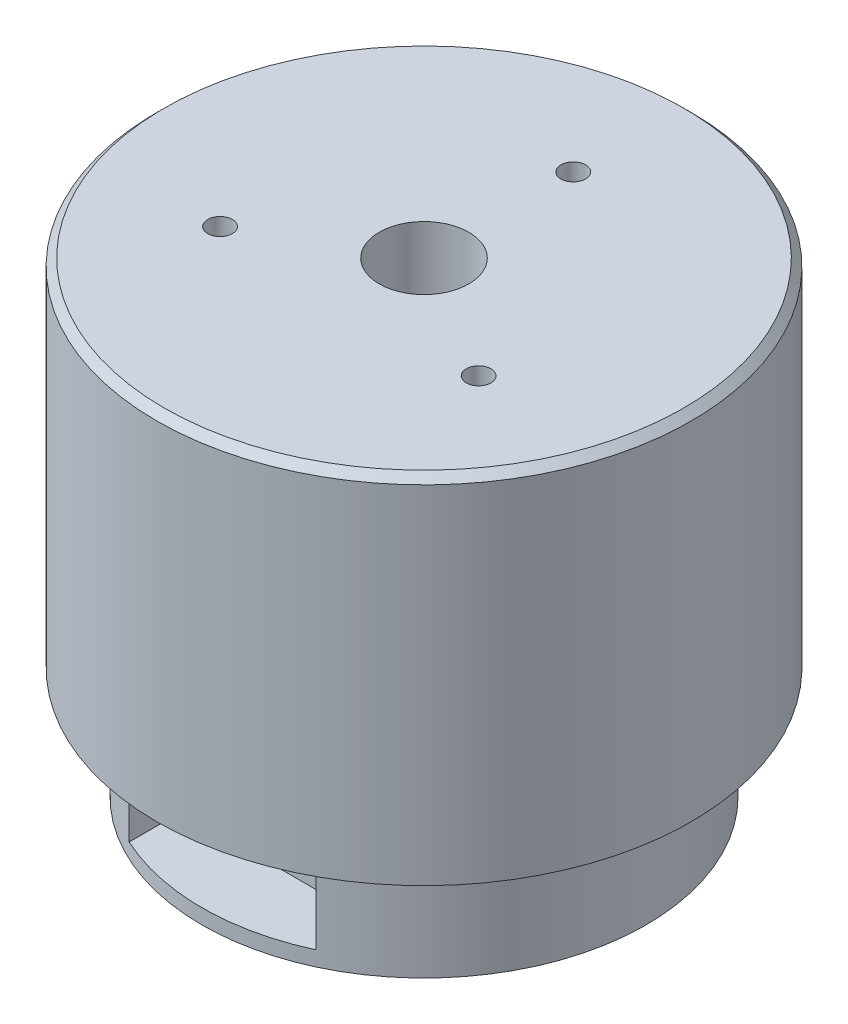
ISO-10303-21;
HEADER;
FILE_DESCRIPTION(('STEP AP214'),'2;1');
FILE_NAME('part.step','',(''),(''),'','','');
FILE_SCHEMA(('AUTOMOTIVE_DESIGN { 1 0 10303 214 1 1 1 1 }'));
ENDSEC;
DATA;
#1=APPLICATION_CONTEXT('core data for automotive mechanical design processes');
#2=APPLICATION_PROTOCOL_DEFINITION('international standard','automotive_design',2000,#1);
#3=PRODUCT_CONTEXT('',#1,'mechanical');
#4=PRODUCT('Part','Part','',(#3));
#5=PRODUCT_RELATED_PRODUCT_CATEGORY('part','',(#4));
#6=PRODUCT_DEFINITION_FORMATION('','',#4);
#7=PRODUCT_DEFINITION_CONTEXT('part definition',#1,'design');
#8=PRODUCT_DEFINITION('design','',#6,#7);
#9=PRODUCT_DEFINITION_SHAPE('','',#8);
#10=(LENGTH_UNIT() NAMED_UNIT(*) SI_UNIT(.MILLI.,.METRE.));
#11=(NAMED_UNIT(*) PLANE_ANGLE_UNIT() SI_UNIT($,.RADIAN.));
#12=(NAMED_UNIT(*) SI_UNIT($,.STERADIAN.) SOLID_ANGLE_UNIT());
#13=UNCERTAINTY_MEASURE_WITH_UNIT(LENGTH_MEASURE(1.E-05),#10,'distance_accuracy_value','');
#14=(GEOMETRIC_REPRESENTATION_CONTEXT(3) GLOBAL_UNCERTAINTY_ASSIGNED_CONTEXT((#13)) GLOBAL_UNIT_ASSIGNED_CONTEXT((#10,
#11,#12)) REPRESENTATION_CONTEXT('',''));
#15=CARTESIAN_POINT('',(0.,0.,0.));
#16=DIRECTION('',(0.,0.,1.));
#17=DIRECTION('',(1.,0.,0.));
#18=AXIS2_PLACEMENT_3D('',#15,#16,#17);
#19=CARTESIAN_POINT('',(0.,16.,0.));
#20=DIRECTION('',(0.,-1.,0.));
#21=DIRECTION('',(0.,0.,-1.));
#22=AXIS2_PLACEMENT_3D('',#19,#20,#21);
#23=CYLINDRICAL_SURFACE('',#22,29.75);
#24=CARTESIAN_POINT('',(0.,0.999999999999999,0.));
#25=DIRECTION('',(0.,1.,0.));
#26=DIRECTION('',(0.,0.,1.));
#27=AXIS2_PLACEMENT_3D('',#24,#25,#26);
#28=CIRCLE('',#27,29.75);
#29=CARTESIAN_POINT('',(0.,0.999999999999999,29.75));
#30=VERTEX_POINT('',#29);
#31=EDGE_CURVE('E152',#30,#30,#28,.T.);
#32=ORIENTED_EDGE('',*,*,#31,.T.);
#33=EDGE_LOOP('',(#32));
#34=FACE_BOUND('',#33,.T.);
#35=DIRECTION('',(0.,-1.,0.));
#36=VECTOR('',#35,1.);
#37=CARTESIAN_POINT('',(-12.5,16.,26.9965275544837));
#38=LINE('',#37,#36);
#39=CARTESIAN_POINT('',(-12.5,16.,26.9965275544837));
#40=VERTEX_POINT('',#39);
#41=CARTESIAN_POINT('',(-12.5,3.,26.9965275544837));
#42=VERTEX_POINT('',#41);
#43=EDGE_CURVE('E89',#40,#42,#38,.T.);
#44=ORIENTED_EDGE('',*,*,#43,.F.);
#45=CARTESIAN_POINT('',(0.,16.,0.));
#46=DIRECTION('',(0.,1.,0.));
#47=DIRECTION('',(0.,0.,1.));
#48=AXIS2_PLACEMENT_3D('',#45,#46,#47);
#49=CIRCLE('',#48,29.75);
#50=CARTESIAN_POINT('',(12.5,16.,26.9965275544837));
#51=VERTEX_POINT('',#50);
#52=EDGE_CURVE('E144',#51,#40,#49,.T.);
#53=ORIENTED_EDGE('',*,*,#52,.F.);
#54=DIRECTION('',(0.,-1.,0.));
#55=VECTOR('',#54,1.);
#56=CARTESIAN_POINT('',(12.5,16.,26.9965275544837));
#57=LINE('',#56,#55);
#58=CARTESIAN_POINT('',(12.5,3.,26.9965275544837));
#59=VERTEX_POINT('',#58);
#60=EDGE_CURVE('E92',#59,#51,#57,.F.);
#61=ORIENTED_EDGE('',*,*,#60,.F.);
#62=CARTESIAN_POINT('',(0.,3.,0.));
#63=DIRECTION('',(0.,1.,0.));
#64=DIRECTION('',(0.,0.,1.));
#65=AXIS2_PLACEMENT_3D('',#62,#63,#64);
#66=CIRCLE('',#65,29.75);
#67=EDGE_CURVE('E11',#42,#59,#66,.T.);
#68=ORIENTED_EDGE('',*,*,#67,.F.);
#69=EDGE_LOOP('',(#44,#53,#61,#68));
#70=FACE_BOUND('',#69,.T.);
#71=ADVANCED_FACE('F36',(#34,#70),#23,.T.);
#72=CARTESIAN_POINT('',(0.,0.,0.));
#73=DIRECTION('',(0.,1.,0.));
#74=DIRECTION('',(0.,0.,1.));
#75=AXIS2_PLACEMENT_3D('',#72,#73,#74);
#76=PLANE('',#75);
#77=CARTESIAN_POINT('',(0.,0.,0.));
#78=DIRECTION('',(0.,1.,0.));
#79=DIRECTION('',(0.,0.,1.));
#80=AXIS2_PLACEMENT_3D('',#77,#78,#79);
#81=CIRCLE('',#80,26.0179491924311);
#82=CARTESIAN_POINT('',(0.,0.,26.0179491924311));
#83=VERTEX_POINT('',#82);
#84=EDGE_CURVE('E44',#83,#83,#81,.F.);
#85=ORIENTED_EDGE('',*,*,#84,.T.);
#86=EDGE_LOOP('',(#85));
#87=FACE_BOUND('',#86,.T.);
#88=ADVANCED_FACE('F157',(#87),#76,.F.);
#89=CARTESIAN_POINT('',(0.,63.5,0.));
#90=DIRECTION('',(0.,-1.,0.));
#91=DIRECTION('',(0.,0.,-1.));
#92=AXIS2_PLACEMENT_3D('',#89,#90,#91);
#93=CYLINDRICAL_SURFACE('',#92,35.8);
#94=CARTESIAN_POINT('',(0.,62.5,0.));
#95=DIRECTION('',(0.,1.,0.));
#96=DIRECTION('',(0.,0.,1.));
#97=AXIS2_PLACEMENT_3D('',#94,#95,#96);
#98=CIRCLE('',#97,35.8);
#99=CARTESIAN_POINT('',(0.,62.5,35.8));
#100=VERTEX_POINT('',#99);
#101=EDGE_CURVE('E149',#100,#100,#98,.F.);
#102=ORIENTED_EDGE('',*,*,#101,.T.);
#103=EDGE_LOOP('',(#102));
#104=FACE_BOUND('',#103,.T.);
#105=CARTESIAN_POINT('',(0.,16.,0.));
#106=DIRECTION('',(0.,1.,0.));
#107=DIRECTION('',(0.,0.,1.));
#108=AXIS2_PLACEMENT_3D('',#105,#106,#107);
#109=CIRCLE('',#108,35.8);
#110=CARTESIAN_POINT('',(0.,16.,35.8));
#111=VERTEX_POINT('',#110);
#112=EDGE_CURVE('E141',#111,#111,#109,.T.);
#113=ORIENTED_EDGE('',*,*,#112,.T.);
#114=EDGE_LOOP('',(#113));
#115=FACE_BOUND('',#114,.T.);
#116=ADVANCED_FACE('F177',(#104,#115),#93,.T.);
#117=CARTESIAN_POINT('',(0.,63.5,0.));
#118=DIRECTION('',(0.,1.,0.));
#119=DIRECTION('',(0.,0.,1.));
#120=AXIS2_PLACEMENT_3D('',#117,#118,#119);
#121=PLANE('',#120);
#122=CARTESIAN_POINT('',(0.,63.5,0.));
#123=DIRECTION('',(0.,1.,0.));
#124=DIRECTION('',(0.,0.,1.));
#125=AXIS2_PLACEMENT_3D('',#122,#123,#124);
#126=CIRCLE('',#125,34.8);
#127=CARTESIAN_POINT('',(0.,63.5,34.8));
#128=VERTEX_POINT('',#127);
#129=EDGE_CURVE('E146',#128,#128,#126,.T.);
#130=ORIENTED_EDGE('',*,*,#129,.T.);
#131=EDGE_LOOP('',(#130));
#132=FACE_BOUND('',#131,.T.);
#133=CARTESIAN_POINT('',(0.,63.5,0.));
#134=DIRECTION('',(0.,1.,0.));
#135=DIRECTION('',(0.,0.,1.));
#136=AXIS2_PLACEMENT_3D('',#133,#134,#135);
#137=CIRCLE('',#136,6.);
#138=CARTESIAN_POINT('',(0.,63.5,6.));
#139=VERTEX_POINT('',#138);
#140=EDGE_CURVE('E117',#139,#139,#137,.T.);
#141=ORIENTED_EDGE('',*,*,#140,.F.);
#142=EDGE_LOOP('',(#141));
#143=FACE_BOUND('',#142,.T.);
#144=CARTESIAN_POINT('',(0.,63.5,-20.));
#145=DIRECTION('',(0.,1.,0.));
#146=DIRECTION('',(0.,0.,1.));
#147=AXIS2_PLACEMENT_3D('',#144,#145,#146);
#148=CIRCLE('',#147,1.65);
#149=CARTESIAN_POINT('',(0.,63.5,-18.35));
#150=VERTEX_POINT('',#149);
#151=EDGE_CURVE('E121',#150,#150,#148,.T.);
#152=ORIENTED_EDGE('',*,*,#151,.F.);
#153=EDGE_LOOP('',(#152));
#154=FACE_BOUND('',#153,.T.);
#155=CARTESIAN_POINT('',(17.3205080756888,63.5,9.99999999999996));
#156=DIRECTION('',(0.,1.,0.));
#157=DIRECTION('',(0.,0.,1.));
#158=AXIS2_PLACEMENT_3D('',#155,#156,#157);
#159=CIRCLE('',#158,1.65);
#160=CARTESIAN_POINT('',(17.3205080756888,63.5,11.65));
#161=VERTEX_POINT('',#160);
#162=EDGE_CURVE('E129',#161,#161,#159,.T.);
#163=ORIENTED_EDGE('',*,*,#162,.F.);
#164=EDGE_LOOP('',(#163));
#165=FACE_BOUND('',#164,.T.);
#166=CARTESIAN_POINT('',(-17.3205080756888,63.5,9.99999999999996));
#167=DIRECTION('',(0.,1.,0.));
#168=DIRECTION('',(0.,0.,1.));
#169=AXIS2_PLACEMENT_3D('',#166,#167,#168);
#170=CIRCLE('',#169,1.65);
#171=CARTESIAN_POINT('',(-17.3205080756888,63.5,11.65));
#172=VERTEX_POINT('',#171);
#173=EDGE_CURVE('E135',#172,#172,#170,.T.);
#174=ORIENTED_EDGE('',*,*,#173,.F.);
#175=EDGE_LOOP('',(#174));
#176=FACE_BOUND('',#175,.T.);
#177=ADVANCED_FACE('F173',(#132,#143,#154,#165,#176),#121,.T.);
#178=CARTESIAN_POINT('',(0.,16.,0.));
#179=DIRECTION('',(0.,1.,0.));
#180=DIRECTION('',(0.,0.,1.));
#181=AXIS2_PLACEMENT_3D('',#178,#179,#180);
#182=PLANE('',#181);
#183=ORIENTED_EDGE('',*,*,#52,.T.);
#184=DIRECTION('',(0.,0.,-1.));
#185=VECTOR('',#184,1.);
#186=CARTESIAN_POINT('',(-12.5,16.,40.));
#187=LINE('',#186,#185);
#188=CARTESIAN_POINT('',(-12.5,16.,20.));
#189=VERTEX_POINT('',#188);
#190=EDGE_CURVE('E111',#40,#189,#187,.T.);
#191=ORIENTED_EDGE('',*,*,#190,.T.);
#192=DIRECTION('',(-1.,0.,0.));
#193=VECTOR('',#192,1.);
#194=CARTESIAN_POINT('',(-12.5,16.,20.));
#195=LINE('',#194,#193);
#196=CARTESIAN_POINT('',(12.5,16.,20.));
#197=VERTEX_POINT('',#196);
#198=EDGE_CURVE('E106',#197,#189,#195,.T.);
#199=ORIENTED_EDGE('',*,*,#198,.F.);
#200=DIRECTION('',(0.,0.,-1.));
#201=VECTOR('',#200,1.);
#202=CARTESIAN_POINT('',(12.5,16.,40.));
#203=LINE('',#202,#201);
#204=EDGE_CURVE('E51',#51,#197,#203,.T.);
#205=ORIENTED_EDGE('',*,*,#204,.F.);
#206=EDGE_LOOP('',(#183,#191,#199,#205));
#207=FACE_BOUND('',#206,.T.);
#208=ORIENTED_EDGE('',*,*,#112,.F.);
#209=EDGE_LOOP('',(#208));
#210=FACE_BOUND('',#209,.T.);
#211=ADVANCED_FACE('F169',(#207,#210),#182,.F.);
#212=CARTESIAN_POINT('',(-17.3205080756888,57.5,9.99999999999996));
#213=DIRECTION('',(0.,1.,0.));
#214=DIRECTION('',(0.,0.,1.));
#215=AXIS2_PLACEMENT_3D('',#212,#213,#214);
#216=CONICAL_SURFACE('',#215,1.65,1.02974425867665);
#217=CARTESIAN_POINT('',(-17.3205080756888,56.5085799786045,9.99999999999996));
#218=VERTEX_POINT('',#217);
#219=VERTEX_LOOP('',#218);
#220=FACE_BOUND('',#219,.T.);
#221=CARTESIAN_POINT('',(-17.3205080756888,57.5,9.99999999999996));
#222=DIRECTION('',(0.,1.,0.));
#223=DIRECTION('',(0.,0.,1.));
#224=AXIS2_PLACEMENT_3D('',#221,#222,#223);
#225=CIRCLE('',#224,1.65);
#226=CARTESIAN_POINT('',(-17.3205080756888,57.5,11.65));
#227=VERTEX_POINT('',#226);
#228=EDGE_CURVE('E138',#227,#227,#225,.T.);
#229=ORIENTED_EDGE('',*,*,#228,.T.);
#230=EDGE_LOOP('',(#229));
#231=FACE_BOUND('',#230,.T.);
#232=ADVANCED_FACE('F172',(#220,#231),#216,.F.);
#233=CARTESIAN_POINT('',(-17.3205080756888,63.5,9.99999999999996));
#234=DIRECTION('',(0.,1.,0.));
#235=DIRECTION('',(0.,0.,1.));
#236=AXIS2_PLACEMENT_3D('',#233,#234,#235);
#237=CYLINDRICAL_SURFACE('',#236,1.65);
#238=ORIENTED_EDGE('',*,*,#228,.F.);
#239=EDGE_LOOP('',(#238));
#240=FACE_BOUND('',#239,.T.);
#241=ORIENTED_EDGE('',*,*,#173,.T.);
#242=EDGE_LOOP('',(#241));
#243=FACE_BOUND('',#242,.T.);
#244=ADVANCED_FACE('F209',(#240,#243),#237,.F.);
#245=CARTESIAN_POINT('',(17.3205080756888,57.5,9.99999999999996));
#246=DIRECTION('',(0.,1.,0.));
#247=DIRECTION('',(0.,0.,1.));
#248=AXIS2_PLACEMENT_3D('',#245,#246,#247);
#249=CONICAL_SURFACE('',#248,1.65,1.02974425867665);
#250=CARTESIAN_POINT('',(17.3205080756888,56.5085799786045,9.99999999999996));
#251=VERTEX_POINT('',#250);
#252=VERTEX_LOOP('',#251);
#253=FACE_BOUND('',#252,.T.);
#254=CARTESIAN_POINT('',(17.3205080756888,57.5,9.99999999999996));
#255=DIRECTION('',(0.,1.,0.));
#256=DIRECTION('',(0.,0.,1.));
#257=AXIS2_PLACEMENT_3D('',#254,#255,#256);
#258=CIRCLE('',#257,1.65);
#259=CARTESIAN_POINT('',(17.3205080756888,57.5,11.65));
#260=VERTEX_POINT('',#259);
#261=EDGE_CURVE('E132',#260,#260,#258,.T.);
#262=ORIENTED_EDGE('',*,*,#261,.T.);
#263=EDGE_LOOP('',(#262));
#264=FACE_BOUND('',#263,.T.);
#265=ADVANCED_FACE('F211',(#253,#264),#249,.F.);
#266=CARTESIAN_POINT('',(17.3205080756888,63.5,9.99999999999996));
#267=DIRECTION('',(0.,1.,0.));
#268=DIRECTION('',(0.,0.,1.));
#269=AXIS2_PLACEMENT_3D('',#266,#267,#268);
#270=CYLINDRICAL_SURFACE('',#269,1.65);
#271=ORIENTED_EDGE('',*,*,#261,.F.);
#272=EDGE_LOOP('',(#271));
#273=FACE_BOUND('',#272,.T.);
#274=ORIENTED_EDGE('',*,*,#162,.T.);
#275=EDGE_LOOP('',(#274));
#276=FACE_BOUND('',#275,.T.);
#277=ADVANCED_FACE('F218',(#273,#276),#270,.F.);
#278=CARTESIAN_POINT('',(0.,57.5,-20.));
#279=DIRECTION('',(0.,1.,0.));
#280=DIRECTION('',(0.,0.,1.));
#281=AXIS2_PLACEMENT_3D('',#278,#279,#280);
#282=CONICAL_SURFACE('',#281,1.65,1.02974425867665);
#283=CARTESIAN_POINT('',(0.,56.5085799786045,-20.));
#284=VERTEX_POINT('',#283);
#285=VERTEX_LOOP('',#284);
#286=FACE_BOUND('',#285,.T.);
#287=CARTESIAN_POINT('',(0.,57.5,-20.));
#288=DIRECTION('',(0.,1.,0.));
#289=DIRECTION('',(0.,0.,1.));
#290=AXIS2_PLACEMENT_3D('',#287,#288,#289);
#291=CIRCLE('',#290,1.65);
#292=CARTESIAN_POINT('',(0.,57.5,-18.35));
#293=VERTEX_POINT('',#292);
#294=EDGE_CURVE('E126',#293,#293,#291,.T.);
#295=ORIENTED_EDGE('',*,*,#294,.T.);
#296=EDGE_LOOP('',(#295));
#297=FACE_BOUND('',#296,.T.);
#298=ADVANCED_FACE('F226',(#286,#297),#282,.F.);
#299=CARTESIAN_POINT('',(0.,63.5,-20.));
#300=DIRECTION('',(0.,1.,0.));
#301=DIRECTION('',(0.,0.,1.));
#302=AXIS2_PLACEMENT_3D('',#299,#300,#301);
#303=CYLINDRICAL_SURFACE('',#302,1.65);
#304=ORIENTED_EDGE('',*,*,#294,.F.);
#305=EDGE_LOOP('',(#304));
#306=FACE_BOUND('',#305,.T.);
#307=ORIENTED_EDGE('',*,*,#151,.T.);
#308=EDGE_LOOP('',(#307));
#309=FACE_BOUND('',#308,.T.);
#310=ADVANCED_FACE('F230',(#306,#309),#303,.F.);
#311=CARTESIAN_POINT('',(0.,43.5,0.));
#312=DIRECTION('',(0.,1.,0.));
#313=DIRECTION('',(0.,0.,1.));
#314=AXIS2_PLACEMENT_3D('',#311,#312,#313);
#315=CYLINDRICAL_SURFACE('',#314,6.);
#316=CARTESIAN_POINT('',(0.,43.5,0.));
#317=DIRECTION('',(0.,1.,0.));
#318=DIRECTION('',(0.,0.,1.));
#319=AXIS2_PLACEMENT_3D('',#316,#317,#318);
#320=CIRCLE('',#319,6.);
#321=CARTESIAN_POINT('',(0.,43.5,6.));
#322=VERTEX_POINT('',#321);
#323=EDGE_CURVE('E118',#322,#322,#320,.T.);
#324=ORIENTED_EDGE('',*,*,#323,.F.);
#325=EDGE_LOOP('',(#324));
#326=FACE_BOUND('',#325,.T.);
#327=ORIENTED_EDGE('',*,*,#140,.T.);
#328=EDGE_LOOP('',(#327));
#329=FACE_BOUND('',#328,.T.);
#330=ADVANCED_FACE('F194',(#326,#329),#315,.F.);
#331=CARTESIAN_POINT('',(0.,43.5,0.));
#332=DIRECTION('',(0.,1.,0.));
#333=DIRECTION('',(0.,0.,1.));
#334=AXIS2_PLACEMENT_3D('',#331,#332,#333);
#335=PLANE('',#334);
#336=ORIENTED_EDGE('',*,*,#323,.T.);
#337=EDGE_LOOP('',(#336));
#338=FACE_BOUND('',#337,.T.);
#339=ADVANCED_FACE('F189',(#338),#335,.T.);
#340=CARTESIAN_POINT('',(0.,63.5,0.));
#341=DIRECTION('',(0.,-1.,0.));
#342=DIRECTION('',(0.,0.,-1.));
#343=AXIS2_PLACEMENT_3D('',#340,#341,#342);
#344=CONICAL_SURFACE('',#343,34.8,0.785398163397441);
#345=ORIENTED_EDGE('',*,*,#101,.F.);
#346=EDGE_LOOP('',(#345));
#347=FACE_BOUND('',#346,.T.);
#348=ORIENTED_EDGE('',*,*,#129,.F.);
#349=EDGE_LOOP('',(#348));
#350=FACE_BOUND('',#349,.T.);
#351=ADVANCED_FACE('F161',(#347,#350),#344,.T.);
#352=CARTESIAN_POINT('',(0.,0.999999999999999,0.));
#353=DIRECTION('',(0.,1.,0.));
#354=DIRECTION('',(0.,0.,1.));
#355=AXIS2_PLACEMENT_3D('',#352,#353,#354);
#356=CONICAL_SURFACE('',#355,29.75,1.30899693899575);
#357=ORIENTED_EDGE('',*,*,#84,.F.);
#358=EDGE_LOOP('',(#357));
#359=FACE_BOUND('',#358,.T.);
#360=ORIENTED_EDGE('',*,*,#31,.F.);
#361=EDGE_LOOP('',(#360));
#362=FACE_BOUND('',#361,.T.);
#363=ADVANCED_FACE('F38',(#359,#362),#356,.T.);
#364=CARTESIAN_POINT('',(-12.5,3.,40.));
#365=DIRECTION('',(0.,1.,0.));
#366=DIRECTION('',(0.,0.,1.));
#367=AXIS2_PLACEMENT_3D('',#364,#365,#366);
#368=PLANE('',#367);
#369=ORIENTED_EDGE('',*,*,#67,.T.);
#370=DIRECTION('',(0.,0.,-1.));
#371=VECTOR('',#370,1.);
#372=CARTESIAN_POINT('',(12.5,3.,40.));
#373=LINE('',#372,#371);
#374=CARTESIAN_POINT('',(12.5,3.,20.));
#375=VERTEX_POINT('',#374);
#376=EDGE_CURVE('E93',#59,#375,#373,.T.);
#377=ORIENTED_EDGE('',*,*,#376,.T.);
#378=DIRECTION('',(1.,0.,0.));
#379=VECTOR('',#378,1.);
#380=CARTESIAN_POINT('',(-12.5,3.,20.));
#381=LINE('',#380,#379);
#382=CARTESIAN_POINT('',(-12.5,3.,20.));
#383=VERTEX_POINT('',#382);
#384=EDGE_CURVE('E96',#383,#375,#381,.T.);
#385=ORIENTED_EDGE('',*,*,#384,.F.);
#386=DIRECTION('',(0.,0.,-1.));
#387=VECTOR('',#386,1.);
#388=CARTESIAN_POINT('',(-12.5,3.,40.));
#389=LINE('',#388,#387);
#390=EDGE_CURVE('E83',#42,#383,#389,.T.);
#391=ORIENTED_EDGE('',*,*,#390,.F.);
#392=EDGE_LOOP('',(#369,#377,#385,#391));
#393=FACE_BOUND('',#392,.T.);
#394=ADVANCED_FACE('F97',(#393),#368,.T.);
#395=CARTESIAN_POINT('',(-12.5,16.,40.));
#396=DIRECTION('',(1.,0.,0.));
#397=DIRECTION('',(0.,0.,-1.));
#398=AXIS2_PLACEMENT_3D('',#395,#396,#397);
#399=PLANE('',#398);
#400=ORIENTED_EDGE('',*,*,#43,.T.);
#401=ORIENTED_EDGE('',*,*,#390,.T.);
#402=DIRECTION('',(0.,-1.,0.));
#403=VECTOR('',#402,1.);
#404=CARTESIAN_POINT('',(-12.5,16.,20.));
#405=LINE('',#404,#403);
#406=EDGE_CURVE('E87',#189,#383,#405,.T.);
#407=ORIENTED_EDGE('',*,*,#406,.F.);
#408=ORIENTED_EDGE('',*,*,#190,.F.);
#409=EDGE_LOOP('',(#400,#401,#407,#408));
#410=FACE_BOUND('',#409,.T.);
#411=ADVANCED_FACE('F85',(#410),#399,.T.);
#412=CARTESIAN_POINT('',(12.5,16.,40.));
#413=DIRECTION('',(-1.,0.,0.));
#414=DIRECTION('',(0.,0.,1.));
#415=AXIS2_PLACEMENT_3D('',#412,#413,#414);
#416=PLANE('',#415);
#417=ORIENTED_EDGE('',*,*,#60,.T.);
#418=ORIENTED_EDGE('',*,*,#204,.T.);
#419=DIRECTION('',(0.,1.,0.));
#420=VECTOR('',#419,1.);
#421=CARTESIAN_POINT('',(12.5,16.,20.));
#422=LINE('',#421,#420);
#423=EDGE_CURVE('E102',#375,#197,#422,.T.);
#424=ORIENTED_EDGE('',*,*,#423,.F.);
#425=ORIENTED_EDGE('',*,*,#376,.F.);
#426=EDGE_LOOP('',(#417,#418,#424,#425));
#427=FACE_BOUND('',#426,.T.);
#428=ADVANCED_FACE('F240',(#427),#416,.T.);
#429=CARTESIAN_POINT('',(0.,0.,20.));
#430=DIRECTION('',(0.,0.,1.));
#431=DIRECTION('',(1.,0.,0.));
#432=AXIS2_PLACEMENT_3D('',#429,#430,#431);
#433=PLANE('',#432);
#434=ORIENTED_EDGE('',*,*,#406,.T.);
#435=ORIENTED_EDGE('',*,*,#384,.T.);
#436=ORIENTED_EDGE('',*,*,#423,.T.);
#437=ORIENTED_EDGE('',*,*,#198,.T.);
#438=EDGE_LOOP('',(#434,#435,#436,#437));
#439=FACE_BOUND('',#438,.T.);
#440=ADVANCED_FACE('F105',(#439),#433,.T.);
#441=CLOSED_SHELL('',(#71,#88,#116,#177,#211,#232,#244,#265,#277,#298,#310,#330,#339,#351,#363,
#394,#411,#428,#440));
#442=MANIFOLD_SOLID_BREP('B2',#441);
#443=ADVANCED_BREP_SHAPE_REPRESENTATION('',(#18,#442),#14);
#444=SHAPE_DEFINITION_REPRESENTATION(#9,#443);
ENDSEC;
END-ISO-10303-21;
